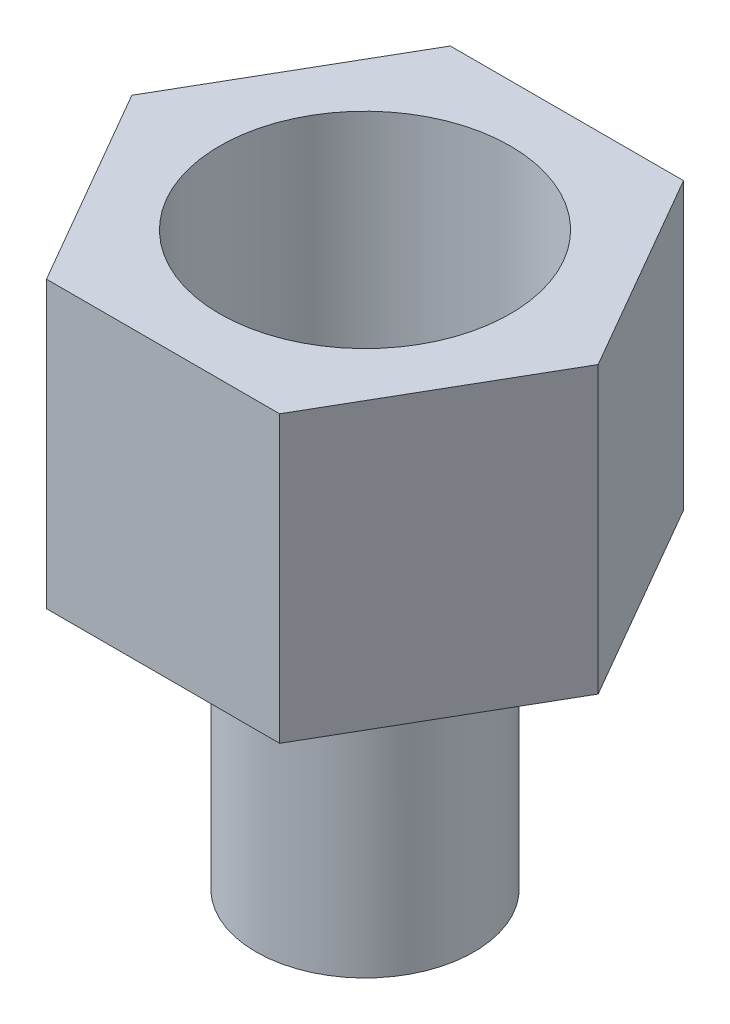
ISO-10303-21;
HEADER;
FILE_DESCRIPTION(('STEP AP214'),'2;1');
FILE_NAME('part.step','',(''),(''),'','','');
FILE_SCHEMA(('AUTOMOTIVE_DESIGN { 1 0 10303 214 1 1 1 1 }'));
ENDSEC;
DATA;
#1=APPLICATION_CONTEXT('core data for automotive mechanical design processes');
#2=APPLICATION_PROTOCOL_DEFINITION('international standard','automotive_design',2000,#1);
#3=PRODUCT_CONTEXT('',#1,'mechanical');
#4=PRODUCT('Part','Part','',(#3));
#5=PRODUCT_RELATED_PRODUCT_CATEGORY('part','',(#4));
#6=PRODUCT_DEFINITION_FORMATION('','',#4);
#7=PRODUCT_DEFINITION_CONTEXT('part definition',#1,'design');
#8=PRODUCT_DEFINITION('design','',#6,#7);
#9=PRODUCT_DEFINITION_SHAPE('','',#8);
#10=(LENGTH_UNIT() NAMED_UNIT(*) SI_UNIT(.MILLI.,.METRE.));
#11=(NAMED_UNIT(*) PLANE_ANGLE_UNIT() SI_UNIT($,.RADIAN.));
#12=(NAMED_UNIT(*) SI_UNIT($,.STERADIAN.) SOLID_ANGLE_UNIT());
#13=UNCERTAINTY_MEASURE_WITH_UNIT(LENGTH_MEASURE(1.E-05),#10,'distance_accuracy_value','');
#14=(GEOMETRIC_REPRESENTATION_CONTEXT(3) GLOBAL_UNCERTAINTY_ASSIGNED_CONTEXT((#13)) GLOBAL_UNIT_ASSIGNED_CONTEXT((#10,
#11,#12)) REPRESENTATION_CONTEXT('',''));
#15=CARTESIAN_POINT('',(0.,0.,0.));
#16=DIRECTION('',(0.,0.,1.));
#17=DIRECTION('',(1.,0.,0.));
#18=AXIS2_PLACEMENT_3D('',#15,#16,#17);
#19=CARTESIAN_POINT('',(10.9985226280624,-13.462,0.));
#20=DIRECTION('',(0.866025403784439,0.,-0.5));
#21=DIRECTION('',(-0.5,0.,-0.866025403784439));
#22=AXIS2_PLACEMENT_3D('',#19,#20,#21);
#23=PLANE('',#22);
#24=DIRECTION('',(-0.5,0.,-0.866025403784439));
#25=VECTOR('',#24,1.);
#26=CARTESIAN_POINT('',(10.9985226280624,0.,0.));
#27=LINE('',#26,#25);
#28=CARTESIAN_POINT('',(10.9985226280624,0.,0.));
#29=VERTEX_POINT('',#28);
#30=CARTESIAN_POINT('',(5.49926131403118,0.,-9.525));
#31=VERTEX_POINT('',#30);
#32=EDGE_CURVE('E120',#29,#31,#27,.T.);
#33=ORIENTED_EDGE('',*,*,#32,.F.);
#34=DIRECTION('',(0.,1.,0.));
#35=VECTOR('',#34,1.);
#36=CARTESIAN_POINT('',(10.9985226280624,-13.462,0.));
#37=LINE('',#36,#35);
#38=CARTESIAN_POINT('',(10.9985226280624,-13.462,0.));
#39=VERTEX_POINT('',#38);
#40=EDGE_CURVE('E42',#39,#29,#37,.T.);
#41=ORIENTED_EDGE('',*,*,#40,.F.);
#42=DIRECTION('',(-0.5,0.,-0.866025403784439));
#43=VECTOR('',#42,1.);
#44=CARTESIAN_POINT('',(10.9985226280624,-13.462,0.));
#45=LINE('',#44,#43);
#46=CARTESIAN_POINT('',(5.49926131403118,-13.462,-9.525));
#47=VERTEX_POINT('',#46);
#48=EDGE_CURVE('E136',#39,#47,#45,.T.);
#49=ORIENTED_EDGE('',*,*,#48,.T.);
#50=DIRECTION('',(0.,1.,0.));
#51=VECTOR('',#50,1.);
#52=CARTESIAN_POINT('',(5.49926131403118,-13.462,-9.525));
#53=LINE('',#52,#51);
#54=EDGE_CURVE('E84',#47,#31,#53,.T.);
#55=ORIENTED_EDGE('',*,*,#54,.T.);
#56=EDGE_LOOP('',(#33,#41,#49,#55));
#57=FACE_BOUND('',#56,.T.);
#58=ADVANCED_FACE('F34',(#57),#23,.T.);
#59=CARTESIAN_POINT('',(5.49926131403119,-13.462,9.525));
#60=DIRECTION('',(0.866025403784439,0.,0.5));
#61=DIRECTION('',(0.5,0.,-0.866025403784439));
#62=AXIS2_PLACEMENT_3D('',#59,#60,#61);
#63=PLANE('',#62);
#64=DIRECTION('',(0.5,0.,-0.866025403784439));
#65=VECTOR('',#64,1.);
#66=CARTESIAN_POINT('',(5.49926131403119,0.,9.525));
#67=LINE('',#66,#65);
#68=CARTESIAN_POINT('',(5.49926131403119,0.,9.525));
#69=VERTEX_POINT('',#68);
#70=EDGE_CURVE('E133',#69,#29,#67,.T.);
#71=ORIENTED_EDGE('',*,*,#70,.F.);
#72=DIRECTION('',(0.,1.,0.));
#73=VECTOR('',#72,1.);
#74=CARTESIAN_POINT('',(5.49926131403119,-13.462,9.525));
#75=LINE('',#74,#73);
#76=CARTESIAN_POINT('',(5.49926131403119,-13.462,9.525));
#77=VERTEX_POINT('',#76);
#78=EDGE_CURVE('E72',#77,#69,#75,.T.);
#79=ORIENTED_EDGE('',*,*,#78,.F.);
#80=DIRECTION('',(0.5,0.,-0.866025403784439));
#81=VECTOR('',#80,1.);
#82=CARTESIAN_POINT('',(5.49926131403119,-13.462,9.525));
#83=LINE('',#82,#81);
#84=EDGE_CURVE('E110',#77,#39,#83,.T.);
#85=ORIENTED_EDGE('',*,*,#84,.T.);
#86=ORIENTED_EDGE('',*,*,#40,.T.);
#87=EDGE_LOOP('',(#71,#79,#85,#86));
#88=FACE_BOUND('',#87,.T.);
#89=ADVANCED_FACE('F145',(#88),#63,.T.);
#90=CARTESIAN_POINT('',(-5.49926131403119,-13.462,9.525));
#91=DIRECTION('',(0.,0.,1.));
#92=DIRECTION('',(1.,0.,0.));
#93=AXIS2_PLACEMENT_3D('',#90,#91,#92);
#94=PLANE('',#93);
#95=DIRECTION('',(1.,0.,0.));
#96=VECTOR('',#95,1.);
#97=CARTESIAN_POINT('',(-5.49926131403119,0.,9.525));
#98=LINE('',#97,#96);
#99=CARTESIAN_POINT('',(-5.49926131403119,0.,9.525));
#100=VERTEX_POINT('',#99);
#101=EDGE_CURVE('E97',#100,#69,#98,.T.);
#102=ORIENTED_EDGE('',*,*,#101,.F.);
#103=DIRECTION('',(0.,1.,0.));
#104=VECTOR('',#103,1.);
#105=CARTESIAN_POINT('',(-5.49926131403119,-13.462,9.525));
#106=LINE('',#105,#104);
#107=CARTESIAN_POINT('',(-5.49926131403119,-13.462,9.525));
#108=VERTEX_POINT('',#107);
#109=EDGE_CURVE('E92',#108,#100,#106,.T.);
#110=ORIENTED_EDGE('',*,*,#109,.F.);
#111=DIRECTION('',(1.,0.,0.));
#112=VECTOR('',#111,1.);
#113=CARTESIAN_POINT('',(-5.49926131403119,-13.462,9.525));
#114=LINE('',#113,#112);
#115=EDGE_CURVE('E95',#108,#77,#114,.T.);
#116=ORIENTED_EDGE('',*,*,#115,.T.);
#117=ORIENTED_EDGE('',*,*,#78,.T.);
#118=EDGE_LOOP('',(#102,#110,#116,#117));
#119=FACE_BOUND('',#118,.T.);
#120=ADVANCED_FACE('F94',(#119),#94,.T.);
#121=CARTESIAN_POINT('',(-10.9985226280624,-13.462,0.));
#122=DIRECTION('',(-0.866025403784439,0.,0.5));
#123=DIRECTION('',(0.5,0.,0.866025403784439));
#124=AXIS2_PLACEMENT_3D('',#121,#122,#123);
#125=PLANE('',#124);
#126=DIRECTION('',(0.5,0.,0.866025403784439));
#127=VECTOR('',#126,1.);
#128=CARTESIAN_POINT('',(-10.9985226280624,0.,0.));
#129=LINE('',#128,#127);
#130=CARTESIAN_POINT('',(-10.9985226280624,0.,0.));
#131=VERTEX_POINT('',#130);
#132=EDGE_CURVE('E130',#131,#100,#129,.T.);
#133=ORIENTED_EDGE('',*,*,#132,.F.);
#134=DIRECTION('',(0.,1.,0.));
#135=VECTOR('',#134,1.);
#136=CARTESIAN_POINT('',(-10.9985226280624,-13.462,0.));
#137=LINE('',#136,#135);
#138=CARTESIAN_POINT('',(-10.9985226280624,-13.462,0.));
#139=VERTEX_POINT('',#138);
#140=EDGE_CURVE('E102',#139,#131,#137,.T.);
#141=ORIENTED_EDGE('',*,*,#140,.F.);
#142=DIRECTION('',(0.5,0.,0.866025403784439));
#143=VECTOR('',#142,1.);
#144=CARTESIAN_POINT('',(-10.9985226280624,-13.462,0.));
#145=LINE('',#144,#143);
#146=EDGE_CURVE('E108',#139,#108,#145,.T.);
#147=ORIENTED_EDGE('',*,*,#146,.T.);
#148=ORIENTED_EDGE('',*,*,#109,.T.);
#149=EDGE_LOOP('',(#133,#141,#147,#148));
#150=FACE_BOUND('',#149,.T.);
#151=ADVANCED_FACE('F112',(#150),#125,.T.);
#152=CARTESIAN_POINT('',(-5.49926131403118,-13.462,-9.525));
#153=DIRECTION('',(-0.866025403784439,0.,-0.5));
#154=DIRECTION('',(-0.5,0.,0.866025403784439));
#155=AXIS2_PLACEMENT_3D('',#152,#153,#154);
#156=PLANE('',#155);
#157=DIRECTION('',(-0.5,0.,0.866025403784439));
#158=VECTOR('',#157,1.);
#159=CARTESIAN_POINT('',(-5.49926131403118,0.,-9.525));
#160=LINE('',#159,#158);
#161=CARTESIAN_POINT('',(-5.49926131403118,0.,-9.525));
#162=VERTEX_POINT('',#161);
#163=EDGE_CURVE('E127',#162,#131,#160,.T.);
#164=ORIENTED_EDGE('',*,*,#163,.F.);
#165=DIRECTION('',(0.,1.,0.));
#166=VECTOR('',#165,1.);
#167=CARTESIAN_POINT('',(-5.49926131403118,-13.462,-9.525));
#168=LINE('',#167,#166);
#169=CARTESIAN_POINT('',(-5.49926131403118,-13.462,-9.525));
#170=VERTEX_POINT('',#169);
#171=EDGE_CURVE('E140',#170,#162,#168,.T.);
#172=ORIENTED_EDGE('',*,*,#171,.F.);
#173=DIRECTION('',(-0.5,0.,0.866025403784439));
#174=VECTOR('',#173,1.);
#175=CARTESIAN_POINT('',(-5.49926131403118,-13.462,-9.525));
#176=LINE('',#175,#174);
#177=EDGE_CURVE('E113',#170,#139,#176,.T.);
#178=ORIENTED_EDGE('',*,*,#177,.T.);
#179=ORIENTED_EDGE('',*,*,#140,.T.);
#180=EDGE_LOOP('',(#164,#172,#178,#179));
#181=FACE_BOUND('',#180,.T.);
#182=ADVANCED_FACE('F158',(#181),#156,.T.);
#183=CARTESIAN_POINT('',(5.49926131403118,-13.462,-9.525));
#184=DIRECTION('',(0.,0.,-1.));
#185=DIRECTION('',(-1.,0.,0.));
#186=AXIS2_PLACEMENT_3D('',#183,#184,#185);
#187=PLANE('',#186);
#188=DIRECTION('',(-1.,0.,0.));
#189=VECTOR('',#188,1.);
#190=CARTESIAN_POINT('',(5.49926131403118,0.,-9.525));
#191=LINE('',#190,#189);
#192=EDGE_CURVE('E123',#31,#162,#191,.T.);
#193=ORIENTED_EDGE('',*,*,#192,.F.);
#194=ORIENTED_EDGE('',*,*,#54,.F.);
#195=DIRECTION('',(-1.,0.,0.));
#196=VECTOR('',#195,1.);
#197=CARTESIAN_POINT('',(5.49926131403118,-13.462,-9.525));
#198=LINE('',#197,#196);
#199=EDGE_CURVE('E115',#47,#170,#198,.T.);
#200=ORIENTED_EDGE('',*,*,#199,.T.);
#201=ORIENTED_EDGE('',*,*,#171,.T.);
#202=EDGE_LOOP('',(#193,#194,#200,#201));
#203=FACE_BOUND('',#202,.T.);
#204=ADVANCED_FACE('F141',(#203),#187,.T.);
#205=CARTESIAN_POINT('',(0.,-13.462,0.));
#206=DIRECTION('',(0.,1.,0.));
#207=DIRECTION('',(0.,0.,1.));
#208=AXIS2_PLACEMENT_3D('',#205,#206,#207);
#209=PLANE('',#208);
#210=CARTESIAN_POINT('',(0.,-13.462,0.));
#211=DIRECTION('',(0.,1.,0.));
#212=DIRECTION('',(0.,0.,1.));
#213=AXIS2_PLACEMENT_3D('',#210,#211,#212);
#214=CIRCLE('',#213,5.1435);
#215=CARTESIAN_POINT('',(0.,-13.462,5.1435));
#216=VERTEX_POINT('',#215);
#217=EDGE_CURVE('E12',#216,#216,#214,.F.);
#218=ORIENTED_EDGE('',*,*,#217,.F.);
#219=EDGE_LOOP('',(#218));
#220=FACE_BOUND('',#219,.T.);
#221=ORIENTED_EDGE('',*,*,#48,.F.);
#222=ORIENTED_EDGE('',*,*,#84,.F.);
#223=ORIENTED_EDGE('',*,*,#115,.F.);
#224=ORIENTED_EDGE('',*,*,#146,.F.);
#225=ORIENTED_EDGE('',*,*,#177,.F.);
#226=ORIENTED_EDGE('',*,*,#199,.F.);
#227=EDGE_LOOP('',(#221,#222,#223,#224,#225,#226));
#228=FACE_BOUND('',#227,.T.);
#229=ADVANCED_FACE('F106',(#220,#228),#209,.F.);
#230=CARTESIAN_POINT('',(0.,0.,0.));
#231=DIRECTION('',(0.,1.,0.));
#232=DIRECTION('',(0.,0.,1.));
#233=AXIS2_PLACEMENT_3D('',#230,#231,#232);
#234=PLANE('',#233);
#235=CARTESIAN_POINT('',(0.,0.,0.));
#236=DIRECTION('',(0.,1.,0.));
#237=DIRECTION('',(0.,0.,1.));
#238=AXIS2_PLACEMENT_3D('',#235,#236,#237);
#239=CIRCLE('',#238,6.858);
#240=CARTESIAN_POINT('',(0.,0.,6.858));
#241=VERTEX_POINT('',#240);
#242=EDGE_CURVE('E206',#241,#241,#239,.T.);
#243=ORIENTED_EDGE('',*,*,#242,.F.);
#244=EDGE_LOOP('',(#243));
#245=FACE_BOUND('',#244,.T.);
#246=ORIENTED_EDGE('',*,*,#32,.T.);
#247=ORIENTED_EDGE('',*,*,#192,.T.);
#248=ORIENTED_EDGE('',*,*,#163,.T.);
#249=ORIENTED_EDGE('',*,*,#132,.T.);
#250=ORIENTED_EDGE('',*,*,#101,.T.);
#251=ORIENTED_EDGE('',*,*,#70,.T.);
#252=EDGE_LOOP('',(#246,#247,#248,#249,#250,#251));
#253=FACE_BOUND('',#252,.T.);
#254=ADVANCED_FACE('F144',(#245,#253),#234,.T.);
#255=CARTESIAN_POINT('',(0.,-32.8593532215094,0.));
#256=DIRECTION('',(0.,1.,0.));
#257=DIRECTION('',(0.,0.,1.));
#258=AXIS2_PLACEMENT_3D('',#255,#256,#257);
#259=CYLINDRICAL_SURFACE('',#258,6.858);
#260=CARTESIAN_POINT('',(0.,-12.954,0.));
#261=DIRECTION('',(0.,1.,0.));
#262=DIRECTION('',(0.,0.,1.));
#263=AXIS2_PLACEMENT_3D('',#260,#261,#262);
#264=CIRCLE('',#263,6.858);
#265=CARTESIAN_POINT('',(0.,-12.954,6.858));
#266=VERTEX_POINT('',#265);
#267=EDGE_CURVE('E124',#266,#266,#264,.F.);
#268=ORIENTED_EDGE('',*,*,#267,.T.);
#269=EDGE_LOOP('',(#268));
#270=FACE_BOUND('',#269,.T.);
#271=ORIENTED_EDGE('',*,*,#242,.T.);
#272=EDGE_LOOP('',(#271));
#273=FACE_BOUND('',#272,.T.);
#274=ADVANCED_FACE('F169',(#270,#273),#259,.F.);
#275=CARTESIAN_POINT('',(0.,-12.954,0.));
#276=DIRECTION('',(0.,1.,0.));
#277=DIRECTION('',(0.,0.,1.));
#278=AXIS2_PLACEMENT_3D('',#275,#276,#277);
#279=PLANE('',#278);
#280=CARTESIAN_POINT('',(0.,-12.954,0.));
#281=DIRECTION('',(0.,1.,0.));
#282=DIRECTION('',(0.,0.,1.));
#283=AXIS2_PLACEMENT_3D('',#280,#281,#282);
#284=CIRCLE('',#283,2.794);
#285=CARTESIAN_POINT('',(0.,-12.954,2.794));
#286=VERTEX_POINT('',#285);
#287=EDGE_CURVE('E196',#286,#286,#284,.T.);
#288=ORIENTED_EDGE('',*,*,#287,.F.);
#289=EDGE_LOOP('',(#288));
#290=FACE_BOUND('',#289,.T.);
#291=ORIENTED_EDGE('',*,*,#267,.F.);
#292=EDGE_LOOP('',(#291));
#293=FACE_BOUND('',#292,.T.);
#294=ADVANCED_FACE('F175',(#290,#293),#279,.T.);
#295=CARTESIAN_POINT('',(0.,-26.924,0.));
#296=DIRECTION('',(0.,1.,0.));
#297=DIRECTION('',(0.,0.,1.));
#298=AXIS2_PLACEMENT_3D('',#295,#296,#297);
#299=CYLINDRICAL_SURFACE('',#298,5.1435);
#300=CARTESIAN_POINT('',(0.,-26.924,0.));
#301=DIRECTION('',(0.,-1.,0.));
#302=DIRECTION('',(0.,0.,-1.));
#303=AXIS2_PLACEMENT_3D('',#300,#301,#302);
#304=CIRCLE('',#303,5.1435);
#305=CARTESIAN_POINT('',(0.,-26.924,-5.1435));
#306=VERTEX_POINT('',#305);
#307=EDGE_CURVE('E201',#306,#306,#304,.T.);
#308=ORIENTED_EDGE('',*,*,#307,.F.);
#309=EDGE_LOOP('',(#308));
#310=FACE_BOUND('',#309,.T.);
#311=ORIENTED_EDGE('',*,*,#217,.T.);
#312=EDGE_LOOP('',(#311));
#313=FACE_BOUND('',#312,.T.);
#314=ADVANCED_FACE('F179',(#310,#313),#299,.T.);
#315=CARTESIAN_POINT('',(0.,-26.924,0.));
#316=DIRECTION('',(0.,-1.,0.));
#317=DIRECTION('',(0.,0.,-1.));
#318=AXIS2_PLACEMENT_3D('',#315,#316,#317);
#319=PLANE('',#318);
#320=CARTESIAN_POINT('',(0.,-26.924,0.));
#321=DIRECTION('',(0.,-1.,0.));
#322=DIRECTION('',(0.,0.,-1.));
#323=AXIS2_PLACEMENT_3D('',#320,#321,#322);
#324=CIRCLE('',#323,2.794);
#325=CARTESIAN_POINT('',(0.,-26.924,-2.794));
#326=VERTEX_POINT('',#325);
#327=EDGE_CURVE('E199',#326,#326,#324,.T.);
#328=ORIENTED_EDGE('',*,*,#327,.F.);
#329=EDGE_LOOP('',(#328));
#330=FACE_BOUND('',#329,.T.);
#331=ORIENTED_EDGE('',*,*,#307,.T.);
#332=EDGE_LOOP('',(#331));
#333=FACE_BOUND('',#332,.T.);
#334=ADVANCED_FACE('F183',(#330,#333),#319,.T.);
#335=CARTESIAN_POINT('',(0.,0.,0.));
#336=DIRECTION('',(0.,-1.,0.));
#337=DIRECTION('',(0.,0.,-1.));
#338=AXIS2_PLACEMENT_3D('',#335,#336,#337);
#339=CYLINDRICAL_SURFACE('',#338,2.794);
#340=ORIENTED_EDGE('',*,*,#287,.T.);
#341=EDGE_LOOP('',(#340));
#342=FACE_BOUND('',#341,.T.);
#343=ORIENTED_EDGE('',*,*,#327,.T.);
#344=EDGE_LOOP('',(#343));
#345=FACE_BOUND('',#344,.T.);
#346=ADVANCED_FACE('F187',(#342,#345),#339,.F.);
#347=CLOSED_SHELL('',(#58,#89,#120,#151,#182,#204,#229,#254,#274,#294,#314,#334,#346));
#348=MANIFOLD_SOLID_BREP('B2',#347);
#349=ADVANCED_BREP_SHAPE_REPRESENTATION('',(#18,#348),#14);
#350=SHAPE_DEFINITION_REPRESENTATION(#9,#349);
ENDSEC;
END-ISO-10303-21;
